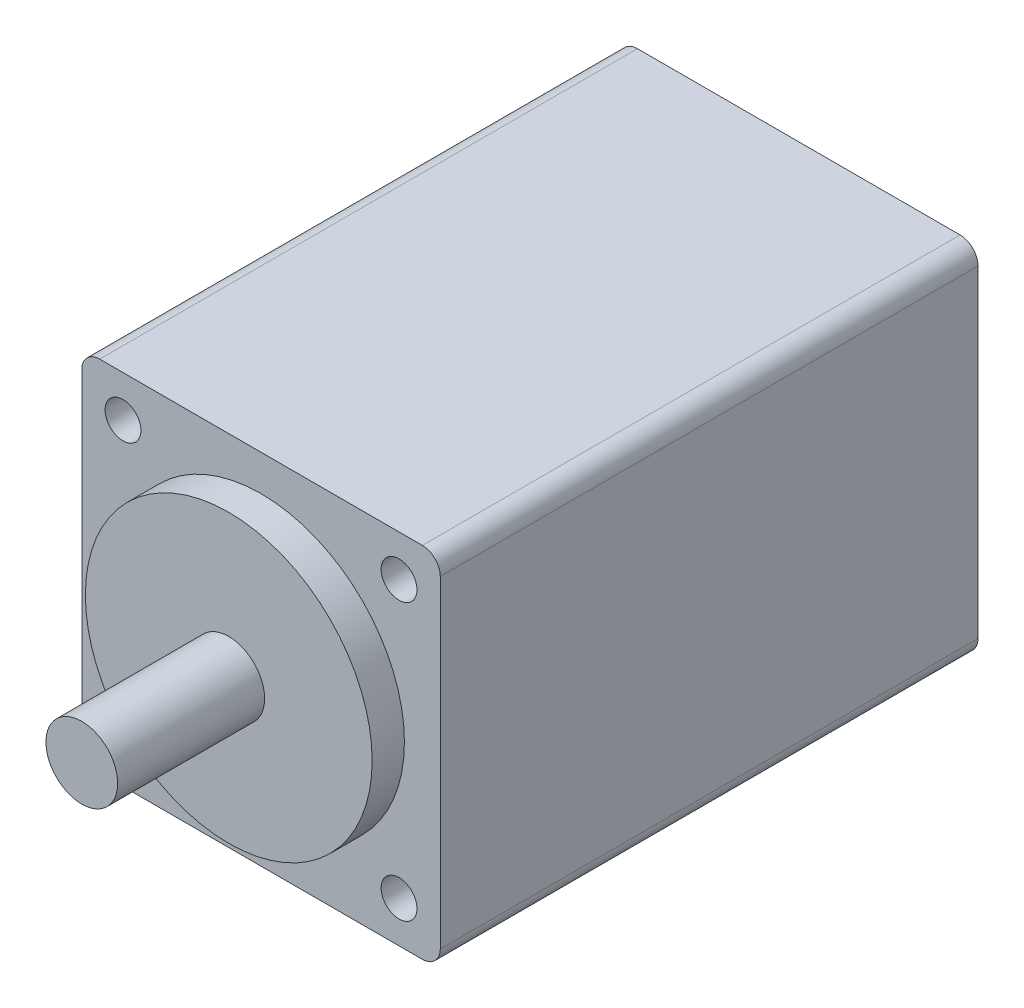
ISO-10303-21;
HEADER;
FILE_DESCRIPTION(('STEP AP214'),'2;1');
FILE_NAME('part.step','',(''),(''),'','','');
FILE_SCHEMA(('AUTOMOTIVE_DESIGN { 1 0 10303 214 1 1 1 1 }'));
ENDSEC;
DATA;
#1=APPLICATION_CONTEXT('core data for automotive mechanical design processes');
#2=APPLICATION_PROTOCOL_DEFINITION('international standard','automotive_design',2000,#1);
#3=PRODUCT_CONTEXT('',#1,'mechanical');
#4=PRODUCT('Part','Part','',(#3));
#5=PRODUCT_RELATED_PRODUCT_CATEGORY('part','',(#4));
#6=PRODUCT_DEFINITION_FORMATION('','',#4);
#7=PRODUCT_DEFINITION_CONTEXT('part definition',#1,'design');
#8=PRODUCT_DEFINITION('design','',#6,#7);
#9=PRODUCT_DEFINITION_SHAPE('','',#8);
#10=(LENGTH_UNIT() NAMED_UNIT(*) SI_UNIT(.MILLI.,.METRE.));
#11=(NAMED_UNIT(*) PLANE_ANGLE_UNIT() SI_UNIT($,.RADIAN.));
#12=(NAMED_UNIT(*) SI_UNIT($,.STERADIAN.) SOLID_ANGLE_UNIT());
#13=UNCERTAINTY_MEASURE_WITH_UNIT(LENGTH_MEASURE(1.E-05),#10,'distance_accuracy_value','');
#14=(GEOMETRIC_REPRESENTATION_CONTEXT(3) GLOBAL_UNCERTAINTY_ASSIGNED_CONTEXT((#13)) GLOBAL_UNIT_ASSIGNED_CONTEXT((#10,
#11,#12)) REPRESENTATION_CONTEXT('',''));
#15=CARTESIAN_POINT('',(0.,0.,0.));
#16=DIRECTION('',(0.,0.,1.));
#17=DIRECTION('',(1.,0.,0.));
#18=AXIS2_PLACEMENT_3D('',#15,#16,#17);
#19=CARTESIAN_POINT('',(10.,10.,30.));
#20=DIRECTION('',(-1.,0.,0.));
#21=DIRECTION('',(0.,-1.,0.));
#22=AXIS2_PLACEMENT_3D('',#19,#20,#21);
#23=PLANE('',#22);
#24=DIRECTION('',(0.,1.,0.));
#25=VECTOR('',#24,1.);
#26=CARTESIAN_POINT('',(10.,10.,30.));
#27=LINE('',#26,#25);
#28=CARTESIAN_POINT('',(10.,-9.,30.));
#29=VERTEX_POINT('',#28);
#30=CARTESIAN_POINT('',(10.,9.,30.));
#31=VERTEX_POINT('',#30);
#32=EDGE_CURVE('E130',#29,#31,#27,.T.);
#33=ORIENTED_EDGE('',*,*,#32,.F.);
#34=DIRECTION('',(0.,0.,-1.));
#35=VECTOR('',#34,1.);
#36=CARTESIAN_POINT('',(10.,-9.,30.));
#37=LINE('',#36,#35);
#38=CARTESIAN_POINT('',(10.,-9.,0.));
#39=VERTEX_POINT('',#38);
#40=EDGE_CURVE('E38',#29,#39,#37,.T.);
#41=ORIENTED_EDGE('',*,*,#40,.T.);
#42=DIRECTION('',(0.,1.,0.));
#43=VECTOR('',#42,1.);
#44=CARTESIAN_POINT('',(10.,10.,0.));
#45=LINE('',#44,#43);
#46=CARTESIAN_POINT('',(10.,9.,0.));
#47=VERTEX_POINT('',#46);
#48=EDGE_CURVE('E175',#39,#47,#45,.T.);
#49=ORIENTED_EDGE('',*,*,#48,.T.);
#50=DIRECTION('',(0.,0.,-1.));
#51=VECTOR('',#50,1.);
#52=CARTESIAN_POINT('',(10.,9.,30.));
#53=LINE('',#52,#51);
#54=EDGE_CURVE('E156',#47,#31,#53,.F.);
#55=ORIENTED_EDGE('',*,*,#54,.T.);
#56=EDGE_LOOP('',(#33,#41,#49,#55));
#57=FACE_BOUND('',#56,.T.);
#58=ADVANCED_FACE('F34',(#57),#23,.F.);
#59=CARTESIAN_POINT('',(-10.,10.,30.));
#60=DIRECTION('',(0.,-1.,0.));
#61=DIRECTION('',(0.,0.,-1.));
#62=AXIS2_PLACEMENT_3D('',#59,#60,#61);
#63=PLANE('',#62);
#64=DIRECTION('',(-1.,0.,0.));
#65=VECTOR('',#64,1.);
#66=CARTESIAN_POINT('',(-10.,10.,0.));
#67=LINE('',#66,#65);
#68=CARTESIAN_POINT('',(9.,10.,0.));
#69=VERTEX_POINT('',#68);
#70=CARTESIAN_POINT('',(-9.,10.,0.));
#71=VERTEX_POINT('',#70);
#72=EDGE_CURVE('E135',#69,#71,#67,.T.);
#73=ORIENTED_EDGE('',*,*,#72,.T.);
#74=DIRECTION('',(0.,0.,-1.));
#75=VECTOR('',#74,1.);
#76=CARTESIAN_POINT('',(-9.,10.,30.));
#77=LINE('',#76,#75);
#78=CARTESIAN_POINT('',(-9.,10.,30.));
#79=VERTEX_POINT('',#78);
#80=EDGE_CURVE('E51',#71,#79,#77,.F.);
#81=ORIENTED_EDGE('',*,*,#80,.T.);
#82=DIRECTION('',(-1.,0.,0.));
#83=VECTOR('',#82,1.);
#84=CARTESIAN_POINT('',(-10.,10.,30.));
#85=LINE('',#84,#83);
#86=CARTESIAN_POINT('',(9.,10.,30.));
#87=VERTEX_POINT('',#86);
#88=EDGE_CURVE('E133',#87,#79,#85,.T.);
#89=ORIENTED_EDGE('',*,*,#88,.F.);
#90=DIRECTION('',(0.,0.,-1.));
#91=VECTOR('',#90,1.);
#92=CARTESIAN_POINT('',(9.,10.,30.));
#93=LINE('',#92,#91);
#94=EDGE_CURVE('E153',#87,#69,#93,.T.);
#95=ORIENTED_EDGE('',*,*,#94,.T.);
#96=EDGE_LOOP('',(#73,#81,#89,#95));
#97=FACE_BOUND('',#96,.T.);
#98=ADVANCED_FACE('F177',(#97),#63,.F.);
#99=CARTESIAN_POINT('',(-10.,10.,30.));
#100=DIRECTION('',(1.,0.,0.));
#101=DIRECTION('',(0.,1.,0.));
#102=AXIS2_PLACEMENT_3D('',#99,#100,#101);
#103=PLANE('',#102);
#104=DIRECTION('',(0.,-1.,0.));
#105=VECTOR('',#104,1.);
#106=CARTESIAN_POINT('',(-10.,10.,0.));
#107=LINE('',#106,#105);
#108=CARTESIAN_POINT('',(-10.,9.,0.));
#109=VERTEX_POINT('',#108);
#110=CARTESIAN_POINT('',(-10.,-9.,0.));
#111=VERTEX_POINT('',#110);
#112=EDGE_CURVE('E131',#109,#111,#107,.T.);
#113=ORIENTED_EDGE('',*,*,#112,.T.);
#114=DIRECTION('',(0.,0.,-1.));
#115=VECTOR('',#114,1.);
#116=CARTESIAN_POINT('',(-10.,-9.,30.));
#117=LINE('',#116,#115);
#118=CARTESIAN_POINT('',(-10.,-9.,30.));
#119=VERTEX_POINT('',#118);
#120=EDGE_CURVE('E108',#111,#119,#117,.F.);
#121=ORIENTED_EDGE('',*,*,#120,.T.);
#122=DIRECTION('',(0.,-1.,0.));
#123=VECTOR('',#122,1.);
#124=CARTESIAN_POINT('',(-10.,10.,30.));
#125=LINE('',#124,#123);
#126=CARTESIAN_POINT('',(-10.,9.,30.));
#127=VERTEX_POINT('',#126);
#128=EDGE_CURVE('E171',#127,#119,#125,.T.);
#129=ORIENTED_EDGE('',*,*,#128,.F.);
#130=DIRECTION('',(0.,0.,-1.));
#131=VECTOR('',#130,1.);
#132=CARTESIAN_POINT('',(-10.,9.,30.));
#133=LINE('',#132,#131);
#134=EDGE_CURVE('E113',#127,#109,#133,.T.);
#135=ORIENTED_EDGE('',*,*,#134,.T.);
#136=EDGE_LOOP('',(#113,#121,#129,#135));
#137=FACE_BOUND('',#136,.T.);
#138=ADVANCED_FACE('F186',(#137),#103,.F.);
#139=CARTESIAN_POINT('',(-10.,-10.,30.));
#140=DIRECTION('',(0.,1.,0.));
#141=DIRECTION('',(0.,0.,1.));
#142=AXIS2_PLACEMENT_3D('',#139,#140,#141);
#143=PLANE('',#142);
#144=DIRECTION('',(1.,0.,0.));
#145=VECTOR('',#144,1.);
#146=CARTESIAN_POINT('',(-10.,-10.,30.));
#147=LINE('',#146,#145);
#148=CARTESIAN_POINT('',(-9.,-10.,30.));
#149=VERTEX_POINT('',#148);
#150=CARTESIAN_POINT('',(9.,-10.,30.));
#151=VERTEX_POINT('',#150);
#152=EDGE_CURVE('E123',#149,#151,#147,.T.);
#153=ORIENTED_EDGE('',*,*,#152,.F.);
#154=DIRECTION('',(0.,0.,-1.));
#155=VECTOR('',#154,1.);
#156=CARTESIAN_POINT('',(-9.,-10.,30.));
#157=LINE('',#156,#155);
#158=CARTESIAN_POINT('',(-9.,-10.,0.));
#159=VERTEX_POINT('',#158);
#160=EDGE_CURVE('E107',#149,#159,#157,.T.);
#161=ORIENTED_EDGE('',*,*,#160,.T.);
#162=DIRECTION('',(1.,0.,0.));
#163=VECTOR('',#162,1.);
#164=CARTESIAN_POINT('',(-10.,-10.,0.));
#165=LINE('',#164,#163);
#166=CARTESIAN_POINT('',(9.,-10.,0.));
#167=VERTEX_POINT('',#166);
#168=EDGE_CURVE('E120',#159,#167,#165,.T.);
#169=ORIENTED_EDGE('',*,*,#168,.T.);
#170=DIRECTION('',(0.,0.,-1.));
#171=VECTOR('',#170,1.);
#172=CARTESIAN_POINT('',(9.,-10.,30.));
#173=LINE('',#172,#171);
#174=EDGE_CURVE('E125',#167,#151,#173,.F.);
#175=ORIENTED_EDGE('',*,*,#174,.T.);
#176=EDGE_LOOP('',(#153,#161,#169,#175));
#177=FACE_BOUND('',#176,.T.);
#178=ADVANCED_FACE('F119',(#177),#143,.F.);
#179=CARTESIAN_POINT('',(0.,0.,30.));
#180=DIRECTION('',(0.,0.,1.));
#181=DIRECTION('',(1.,0.,0.));
#182=AXIS2_PLACEMENT_3D('',#179,#180,#181);
#183=PLANE('',#182);
#184=CARTESIAN_POINT('',(-7.7,-7.7,30.));
#185=DIRECTION('',(0.,0.,1.));
#186=DIRECTION('',(1.,0.,0.));
#187=AXIS2_PLACEMENT_3D('',#184,#185,#186);
#188=CIRCLE('',#187,1.);
#189=CARTESIAN_POINT('',(-6.7,-7.7,30.));
#190=VERTEX_POINT('',#189);
#191=EDGE_CURVE('E374',#190,#190,#188,.T.);
#192=ORIENTED_EDGE('',*,*,#191,.F.);
#193=EDGE_LOOP('',(#192));
#194=FACE_BOUND('',#193,.T.);
#195=CARTESIAN_POINT('',(7.7,-7.7,30.));
#196=DIRECTION('',(0.,0.,1.));
#197=DIRECTION('',(1.,0.,0.));
#198=AXIS2_PLACEMENT_3D('',#195,#196,#197);
#199=CIRCLE('',#198,1.);
#200=CARTESIAN_POINT('',(8.7,-7.7,30.));
#201=VERTEX_POINT('',#200);
#202=EDGE_CURVE('E373',#201,#201,#199,.T.);
#203=ORIENTED_EDGE('',*,*,#202,.F.);
#204=EDGE_LOOP('',(#203));
#205=FACE_BOUND('',#204,.T.);
#206=CARTESIAN_POINT('',(7.7,7.7,30.));
#207=DIRECTION('',(0.,0.,1.));
#208=DIRECTION('',(1.,0.,0.));
#209=AXIS2_PLACEMENT_3D('',#206,#207,#208);
#210=CIRCLE('',#209,1.);
#211=CARTESIAN_POINT('',(8.7,7.7,30.));
#212=VERTEX_POINT('',#211);
#213=EDGE_CURVE('E400',#212,#212,#210,.T.);
#214=ORIENTED_EDGE('',*,*,#213,.F.);
#215=EDGE_LOOP('',(#214));
#216=FACE_BOUND('',#215,.T.);
#217=CARTESIAN_POINT('',(-7.7,7.7,30.));
#218=DIRECTION('',(0.,0.,1.));
#219=DIRECTION('',(1.,0.,0.));
#220=AXIS2_PLACEMENT_3D('',#217,#218,#219);
#221=CIRCLE('',#220,1.);
#222=CARTESIAN_POINT('',(-6.7,7.7,30.));
#223=VERTEX_POINT('',#222);
#224=EDGE_CURVE('E387',#223,#223,#221,.T.);
#225=ORIENTED_EDGE('',*,*,#224,.F.);
#226=EDGE_LOOP('',(#225));
#227=FACE_BOUND('',#226,.T.);
#228=CARTESIAN_POINT('',(0.,0.,30.));
#229=DIRECTION('',(0.,0.,1.));
#230=DIRECTION('',(1.,0.,0.));
#231=AXIS2_PLACEMENT_3D('',#228,#229,#230);
#232=CIRCLE('',#231,8.);
#233=CARTESIAN_POINT('',(8.,0.,30.));
#234=VERTEX_POINT('',#233);
#235=EDGE_CURVE('E43',#234,#234,#232,.T.);
#236=ORIENTED_EDGE('',*,*,#235,.F.);
#237=EDGE_LOOP('',(#236));
#238=FACE_BOUND('',#237,.T.);
#239=ORIENTED_EDGE('',*,*,#128,.T.);
#240=CARTESIAN_POINT('',(-9.,-9.,30.));
#241=DIRECTION('',(0.,0.,1.));
#242=DIRECTION('',(1.,0.,0.));
#243=AXIS2_PLACEMENT_3D('',#240,#241,#242);
#244=CIRCLE('',#243,1.);
#245=EDGE_CURVE('E151',#119,#149,#244,.T.);
#246=ORIENTED_EDGE('',*,*,#245,.T.);
#247=ORIENTED_EDGE('',*,*,#152,.T.);
#248=CARTESIAN_POINT('',(9.,-9.,30.));
#249=DIRECTION('',(0.,0.,1.));
#250=DIRECTION('',(1.,0.,0.));
#251=AXIS2_PLACEMENT_3D('',#248,#249,#250);
#252=CIRCLE('',#251,1.);
#253=EDGE_CURVE('E147',#151,#29,#252,.T.);
#254=ORIENTED_EDGE('',*,*,#253,.T.);
#255=ORIENTED_EDGE('',*,*,#32,.T.);
#256=CARTESIAN_POINT('',(9.,9.,30.));
#257=DIRECTION('',(0.,0.,1.));
#258=DIRECTION('',(1.,0.,0.));
#259=AXIS2_PLACEMENT_3D('',#256,#257,#258);
#260=CIRCLE('',#259,1.);
#261=EDGE_CURVE('E58',#31,#87,#260,.T.);
#262=ORIENTED_EDGE('',*,*,#261,.T.);
#263=ORIENTED_EDGE('',*,*,#88,.T.);
#264=CARTESIAN_POINT('',(-9.,9.,30.));
#265=DIRECTION('',(0.,0.,1.));
#266=DIRECTION('',(1.,0.,0.));
#267=AXIS2_PLACEMENT_3D('',#264,#265,#266);
#268=CIRCLE('',#267,1.);
#269=EDGE_CURVE('E149',#79,#127,#268,.T.);
#270=ORIENTED_EDGE('',*,*,#269,.T.);
#271=EDGE_LOOP('',(#239,#246,#247,#254,#255,#262,#263,#270));
#272=FACE_BOUND('',#271,.T.);
#273=ADVANCED_FACE('F184',(#194,#205,#216,#227,#238,#272),#183,.T.);
#274=CARTESIAN_POINT('',(0.,0.,0.));
#275=DIRECTION('',(0.,0.,1.));
#276=DIRECTION('',(1.,0.,0.));
#277=AXIS2_PLACEMENT_3D('',#274,#275,#276);
#278=PLANE('',#277);
#279=ORIENTED_EDGE('',*,*,#168,.F.);
#280=CARTESIAN_POINT('',(-9.,-9.,0.));
#281=DIRECTION('',(0.,0.,1.));
#282=DIRECTION('',(1.,0.,0.));
#283=AXIS2_PLACEMENT_3D('',#280,#281,#282);
#284=CIRCLE('',#283,1.);
#285=EDGE_CURVE('E103',#159,#111,#284,.F.);
#286=ORIENTED_EDGE('',*,*,#285,.T.);
#287=ORIENTED_EDGE('',*,*,#112,.F.);
#288=CARTESIAN_POINT('',(-9.,9.,0.));
#289=DIRECTION('',(0.,0.,1.));
#290=DIRECTION('',(1.,0.,0.));
#291=AXIS2_PLACEMENT_3D('',#288,#289,#290);
#292=CIRCLE('',#291,1.);
#293=EDGE_CURVE('E114',#109,#71,#292,.F.);
#294=ORIENTED_EDGE('',*,*,#293,.T.);
#295=ORIENTED_EDGE('',*,*,#72,.F.);
#296=CARTESIAN_POINT('',(9.,9.,0.));
#297=DIRECTION('',(0.,0.,1.));
#298=DIRECTION('',(1.,0.,0.));
#299=AXIS2_PLACEMENT_3D('',#296,#297,#298);
#300=CIRCLE('',#299,1.);
#301=EDGE_CURVE('E124',#69,#47,#300,.F.);
#302=ORIENTED_EDGE('',*,*,#301,.T.);
#303=ORIENTED_EDGE('',*,*,#48,.F.);
#304=CARTESIAN_POINT('',(9.,-9.,0.));
#305=DIRECTION('',(0.,0.,1.));
#306=DIRECTION('',(1.,0.,0.));
#307=AXIS2_PLACEMENT_3D('',#304,#305,#306);
#308=CIRCLE('',#307,1.);
#309=EDGE_CURVE('E129',#39,#167,#308,.F.);
#310=ORIENTED_EDGE('',*,*,#309,.T.);
#311=EDGE_LOOP('',(#279,#286,#287,#294,#295,#302,#303,#310));
#312=FACE_BOUND('',#311,.T.);
#313=ADVANCED_FACE('F127',(#312),#278,.F.);
#314=CARTESIAN_POINT('',(-9.,-9.,30.));
#315=DIRECTION('',(0.,0.,-1.));
#316=DIRECTION('',(-1.,0.,0.));
#317=AXIS2_PLACEMENT_3D('',#314,#315,#316);
#318=CYLINDRICAL_SURFACE('',#317,1.);
#319=ORIENTED_EDGE('',*,*,#245,.F.);
#320=ORIENTED_EDGE('',*,*,#120,.F.);
#321=ORIENTED_EDGE('',*,*,#285,.F.);
#322=ORIENTED_EDGE('',*,*,#160,.F.);
#323=EDGE_LOOP('',(#319,#320,#321,#322));
#324=FACE_BOUND('',#323,.T.);
#325=ADVANCED_FACE('F106',(#324),#318,.T.);
#326=CARTESIAN_POINT('',(-9.,9.,30.));
#327=DIRECTION('',(0.,0.,-1.));
#328=DIRECTION('',(-1.,0.,0.));
#329=AXIS2_PLACEMENT_3D('',#326,#327,#328);
#330=CYLINDRICAL_SURFACE('',#329,1.);
#331=ORIENTED_EDGE('',*,*,#269,.F.);
#332=ORIENTED_EDGE('',*,*,#80,.F.);
#333=ORIENTED_EDGE('',*,*,#293,.F.);
#334=ORIENTED_EDGE('',*,*,#134,.F.);
#335=EDGE_LOOP('',(#331,#332,#333,#334));
#336=FACE_BOUND('',#335,.T.);
#337=ADVANCED_FACE('F181',(#336),#330,.T.);
#338=CARTESIAN_POINT('',(9.,-9.,30.));
#339=DIRECTION('',(0.,0.,-1.));
#340=DIRECTION('',(-1.,0.,0.));
#341=AXIS2_PLACEMENT_3D('',#338,#339,#340);
#342=CYLINDRICAL_SURFACE('',#341,1.);
#343=ORIENTED_EDGE('',*,*,#253,.F.);
#344=ORIENTED_EDGE('',*,*,#174,.F.);
#345=ORIENTED_EDGE('',*,*,#309,.F.);
#346=ORIENTED_EDGE('',*,*,#40,.F.);
#347=EDGE_LOOP('',(#343,#344,#345,#346));
#348=FACE_BOUND('',#347,.T.);
#349=ADVANCED_FACE('F203',(#348),#342,.T.);
#350=CARTESIAN_POINT('',(9.,9.,30.));
#351=DIRECTION('',(0.,0.,-1.));
#352=DIRECTION('',(-1.,0.,0.));
#353=AXIS2_PLACEMENT_3D('',#350,#351,#352);
#354=CYLINDRICAL_SURFACE('',#353,1.);
#355=ORIENTED_EDGE('',*,*,#261,.F.);
#356=ORIENTED_EDGE('',*,*,#54,.F.);
#357=ORIENTED_EDGE('',*,*,#301,.F.);
#358=ORIENTED_EDGE('',*,*,#94,.F.);
#359=EDGE_LOOP('',(#355,#356,#357,#358));
#360=FACE_BOUND('',#359,.T.);
#361=ADVANCED_FACE('F36',(#360),#354,.T.);
#362=CARTESIAN_POINT('',(0.,0.,31.8));
#363=DIRECTION('',(0.,0.,-1.));
#364=DIRECTION('',(-1.,0.,0.));
#365=AXIS2_PLACEMENT_3D('',#362,#363,#364);
#366=CYLINDRICAL_SURFACE('',#365,8.);
#367=CARTESIAN_POINT('',(0.,0.,31.8));
#368=DIRECTION('',(0.,0.,1.));
#369=DIRECTION('',(1.,0.,0.));
#370=AXIS2_PLACEMENT_3D('',#367,#368,#369);
#371=CIRCLE('',#370,8.);
#372=CARTESIAN_POINT('',(8.,0.,31.8));
#373=VERTEX_POINT('',#372);
#374=EDGE_CURVE('E168',#373,#373,#371,.T.);
#375=ORIENTED_EDGE('',*,*,#374,.F.);
#376=EDGE_LOOP('',(#375));
#377=FACE_BOUND('',#376,.T.);
#378=ORIENTED_EDGE('',*,*,#235,.T.);
#379=EDGE_LOOP('',(#378));
#380=FACE_BOUND('',#379,.T.);
#381=ADVANCED_FACE('F209',(#377,#380),#366,.T.);
#382=CARTESIAN_POINT('',(0.,0.,31.8));
#383=DIRECTION('',(0.,0.,1.));
#384=DIRECTION('',(1.,0.,0.));
#385=AXIS2_PLACEMENT_3D('',#382,#383,#384);
#386=PLANE('',#385);
#387=CARTESIAN_POINT('',(0.,0.,31.8));
#388=DIRECTION('',(0.,0.,1.));
#389=DIRECTION('',(1.,0.,0.));
#390=AXIS2_PLACEMENT_3D('',#387,#388,#389);
#391=CIRCLE('',#390,2.);
#392=CARTESIAN_POINT('',(2.,0.,31.8));
#393=VERTEX_POINT('',#392);
#394=EDGE_CURVE('E11',#393,#393,#391,.T.);
#395=ORIENTED_EDGE('',*,*,#394,.F.);
#396=EDGE_LOOP('',(#395));
#397=FACE_BOUND('',#396,.T.);
#398=ORIENTED_EDGE('',*,*,#374,.T.);
#399=EDGE_LOOP('',(#398));
#400=FACE_BOUND('',#399,.T.);
#401=ADVANCED_FACE('F215',(#397,#400),#386,.T.);
#402=CARTESIAN_POINT('',(0.,0.,40.));
#403=DIRECTION('',(0.,0.,-1.));
#404=DIRECTION('',(-1.,0.,0.));
#405=AXIS2_PLACEMENT_3D('',#402,#403,#404);
#406=CYLINDRICAL_SURFACE('',#405,2.);
#407=CARTESIAN_POINT('',(0.,0.,40.));
#408=DIRECTION('',(0.,0.,1.));
#409=DIRECTION('',(1.,0.,0.));
#410=AXIS2_PLACEMENT_3D('',#407,#408,#409);
#411=CIRCLE('',#410,2.);
#412=CARTESIAN_POINT('',(2.,0.,40.));
#413=VERTEX_POINT('',#412);
#414=EDGE_CURVE('E386',#413,#413,#411,.T.);
#415=ORIENTED_EDGE('',*,*,#414,.F.);
#416=EDGE_LOOP('',(#415));
#417=FACE_BOUND('',#416,.T.);
#418=ORIENTED_EDGE('',*,*,#394,.T.);
#419=EDGE_LOOP('',(#418));
#420=FACE_BOUND('',#419,.T.);
#421=ADVANCED_FACE('F221',(#417,#420),#406,.T.);
#422=CARTESIAN_POINT('',(0.,0.,40.));
#423=DIRECTION('',(0.,0.,1.));
#424=DIRECTION('',(1.,0.,0.));
#425=AXIS2_PLACEMENT_3D('',#422,#423,#424);
#426=PLANE('',#425);
#427=ORIENTED_EDGE('',*,*,#414,.T.);
#428=EDGE_LOOP('',(#427));
#429=FACE_BOUND('',#428,.T.);
#430=ADVANCED_FACE('F272',(#429),#426,.T.);
#431=CARTESIAN_POINT('',(-7.7,7.7,27.));
#432=DIRECTION('',(0.,0.,1.));
#433=DIRECTION('',(1.,0.,0.));
#434=AXIS2_PLACEMENT_3D('',#431,#432,#433);
#435=CYLINDRICAL_SURFACE('',#434,1.);
#436=CARTESIAN_POINT('',(-7.7,7.7,27.));
#437=DIRECTION('',(0.,0.,1.));
#438=DIRECTION('',(1.,0.,0.));
#439=AXIS2_PLACEMENT_3D('',#436,#437,#438);
#440=CIRCLE('',#439,1.);
#441=CARTESIAN_POINT('',(-6.7,7.7,27.));
#442=VERTEX_POINT('',#441);
#443=EDGE_CURVE('E383',#442,#442,#440,.T.);
#444=ORIENTED_EDGE('',*,*,#443,.F.);
#445=EDGE_LOOP('',(#444));
#446=FACE_BOUND('',#445,.T.);
#447=ORIENTED_EDGE('',*,*,#224,.T.);
#448=EDGE_LOOP('',(#447));
#449=FACE_BOUND('',#448,.T.);
#450=ADVANCED_FACE('F280',(#446,#449),#435,.F.);
#451=CARTESIAN_POINT('',(-7.7,7.7,27.));
#452=DIRECTION('',(0.,0.,1.));
#453=DIRECTION('',(1.,0.,0.));
#454=AXIS2_PLACEMENT_3D('',#451,#452,#453);
#455=PLANE('',#454);
#456=ORIENTED_EDGE('',*,*,#443,.T.);
#457=EDGE_LOOP('',(#456));
#458=FACE_BOUND('',#457,.T.);
#459=ADVANCED_FACE('F296',(#458),#455,.T.);
#460=CARTESIAN_POINT('',(7.7,7.7,27.));
#461=DIRECTION('',(0.,0.,1.));
#462=DIRECTION('',(1.,0.,0.));
#463=AXIS2_PLACEMENT_3D('',#460,#461,#462);
#464=CYLINDRICAL_SURFACE('',#463,1.);
#465=CARTESIAN_POINT('',(7.7,7.7,27.));
#466=DIRECTION('',(0.,0.,1.));
#467=DIRECTION('',(1.,0.,0.));
#468=AXIS2_PLACEMENT_3D('',#465,#466,#467);
#469=CIRCLE('',#468,1.);
#470=CARTESIAN_POINT('',(8.7,7.7,27.));
#471=VERTEX_POINT('',#470);
#472=EDGE_CURVE('E390',#471,#471,#469,.T.);
#473=ORIENTED_EDGE('',*,*,#472,.F.);
#474=EDGE_LOOP('',(#473));
#475=FACE_BOUND('',#474,.T.);
#476=ORIENTED_EDGE('',*,*,#213,.T.);
#477=EDGE_LOOP('',(#476));
#478=FACE_BOUND('',#477,.T.);
#479=ADVANCED_FACE('F306',(#475,#478),#464,.F.);
#480=CARTESIAN_POINT('',(7.7,7.7,27.));
#481=DIRECTION('',(0.,0.,1.));
#482=DIRECTION('',(1.,0.,0.));
#483=AXIS2_PLACEMENT_3D('',#480,#481,#482);
#484=PLANE('',#483);
#485=ORIENTED_EDGE('',*,*,#472,.T.);
#486=EDGE_LOOP('',(#485));
#487=FACE_BOUND('',#486,.T.);
#488=ADVANCED_FACE('F316',(#487),#484,.T.);
#489=CARTESIAN_POINT('',(7.7,-7.7,27.));
#490=DIRECTION('',(0.,0.,1.));
#491=DIRECTION('',(1.,0.,0.));
#492=AXIS2_PLACEMENT_3D('',#489,#490,#491);
#493=CYLINDRICAL_SURFACE('',#492,1.);
#494=CARTESIAN_POINT('',(7.7,-7.7,27.));
#495=DIRECTION('',(0.,0.,1.));
#496=DIRECTION('',(1.,0.,0.));
#497=AXIS2_PLACEMENT_3D('',#494,#495,#496);
#498=CIRCLE('',#497,1.);
#499=CARTESIAN_POINT('',(8.7,-7.7,27.));
#500=VERTEX_POINT('',#499);
#501=EDGE_CURVE('E377',#500,#500,#498,.T.);
#502=ORIENTED_EDGE('',*,*,#501,.F.);
#503=EDGE_LOOP('',(#502));
#504=FACE_BOUND('',#503,.T.);
#505=ORIENTED_EDGE('',*,*,#202,.T.);
#506=EDGE_LOOP('',(#505));
#507=FACE_BOUND('',#506,.T.);
#508=ADVANCED_FACE('F326',(#504,#507),#493,.F.);
#509=CARTESIAN_POINT('',(7.7,-7.7,27.));
#510=DIRECTION('',(0.,0.,1.));
#511=DIRECTION('',(1.,0.,0.));
#512=AXIS2_PLACEMENT_3D('',#509,#510,#511);
#513=PLANE('',#512);
#514=ORIENTED_EDGE('',*,*,#501,.T.);
#515=EDGE_LOOP('',(#514));
#516=FACE_BOUND('',#515,.T.);
#517=ADVANCED_FACE('F336',(#516),#513,.T.);
#518=CARTESIAN_POINT('',(-7.7,-7.7,27.));
#519=DIRECTION('',(0.,0.,1.));
#520=DIRECTION('',(1.,0.,0.));
#521=AXIS2_PLACEMENT_3D('',#518,#519,#520);
#522=CYLINDRICAL_SURFACE('',#521,1.);
#523=CARTESIAN_POINT('',(-7.7,-7.7,27.));
#524=DIRECTION('',(0.,0.,1.));
#525=DIRECTION('',(1.,0.,0.));
#526=AXIS2_PLACEMENT_3D('',#523,#524,#525);
#527=CIRCLE('',#526,1.);
#528=CARTESIAN_POINT('',(-6.7,-7.7,27.));
#529=VERTEX_POINT('',#528);
#530=EDGE_CURVE('E372',#529,#529,#527,.T.);
#531=ORIENTED_EDGE('',*,*,#530,.F.);
#532=EDGE_LOOP('',(#531));
#533=FACE_BOUND('',#532,.T.);
#534=ORIENTED_EDGE('',*,*,#191,.T.);
#535=EDGE_LOOP('',(#534));
#536=FACE_BOUND('',#535,.T.);
#537=ADVANCED_FACE('F346',(#533,#536),#522,.F.);
#538=CARTESIAN_POINT('',(-7.7,-7.7,27.));
#539=DIRECTION('',(0.,0.,1.));
#540=DIRECTION('',(1.,0.,0.));
#541=AXIS2_PLACEMENT_3D('',#538,#539,#540);
#542=PLANE('',#541);
#543=ORIENTED_EDGE('',*,*,#530,.T.);
#544=EDGE_LOOP('',(#543));
#545=FACE_BOUND('',#544,.T.);
#546=ADVANCED_FACE('F356',(#545),#542,.T.);
#547=CLOSED_SHELL('',(#58,#98,#138,#178,#273,#313,#325,#337,#349,#361,#381,#401,#421,#430,#450,
#459,#479,#488,#508,#517,#537,#546));
#548=MANIFOLD_SOLID_BREP('B2',#547);
#549=ADVANCED_BREP_SHAPE_REPRESENTATION('',(#18,#548),#14);
#550=SHAPE_DEFINITION_REPRESENTATION(#9,#549);
ENDSEC;
END-ISO-10303-21;
